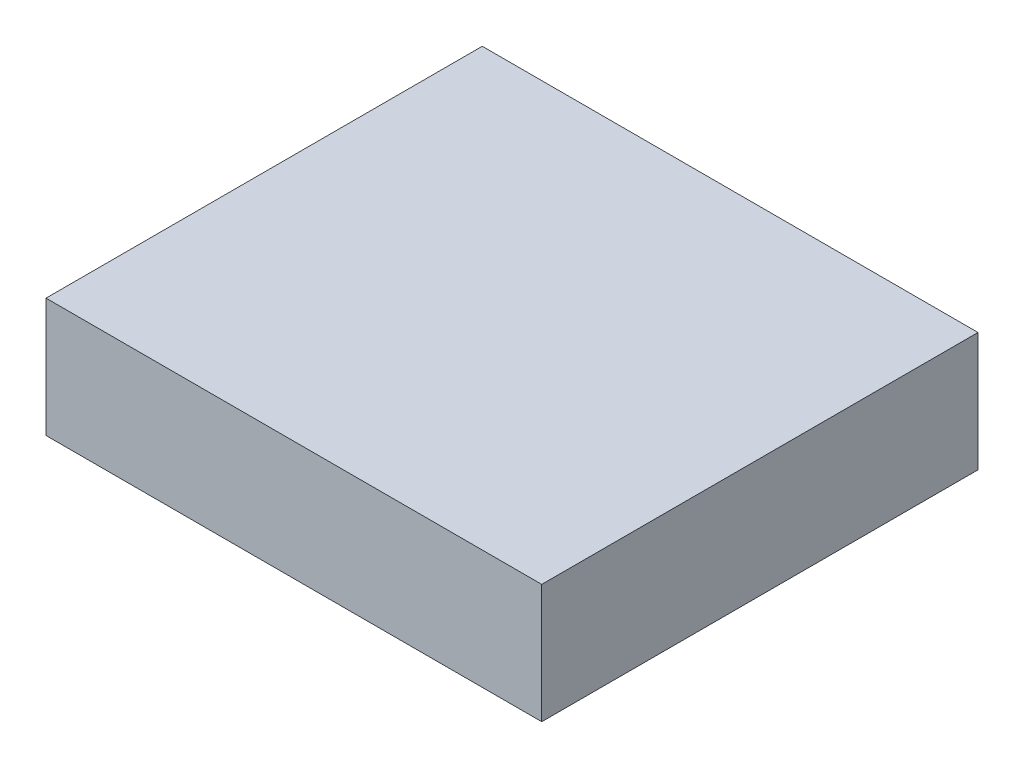
ISO-10303-21;
HEADER;
FILE_DESCRIPTION(('STEP AP214'),'2;1');
FILE_NAME('part.step','',(''),(''),'','','');
FILE_SCHEMA(('AUTOMOTIVE_DESIGN { 1 0 10303 214 1 1 1 1 }'));
ENDSEC;
DATA;
#1=APPLICATION_CONTEXT('core data for automotive mechanical design processes');
#2=APPLICATION_PROTOCOL_DEFINITION('international standard','automotive_design',2000,#1);
#3=PRODUCT_CONTEXT('',#1,'mechanical');
#4=PRODUCT('Part','Part','',(#3));
#5=PRODUCT_RELATED_PRODUCT_CATEGORY('part','',(#4));
#6=PRODUCT_DEFINITION_FORMATION('','',#4);
#7=PRODUCT_DEFINITION_CONTEXT('part definition',#1,'design');
#8=PRODUCT_DEFINITION('design','',#6,#7);
#9=PRODUCT_DEFINITION_SHAPE('','',#8);
#10=(LENGTH_UNIT() NAMED_UNIT(*) SI_UNIT(.MILLI.,.METRE.));
#11=(NAMED_UNIT(*) PLANE_ANGLE_UNIT() SI_UNIT($,.RADIAN.));
#12=(NAMED_UNIT(*) SI_UNIT($,.STERADIAN.) SOLID_ANGLE_UNIT());
#13=UNCERTAINTY_MEASURE_WITH_UNIT(LENGTH_MEASURE(1.E-05),#10,'distance_accuracy_value','');
#14=(GEOMETRIC_REPRESENTATION_CONTEXT(3) GLOBAL_UNCERTAINTY_ASSIGNED_CONTEXT((#13)) GLOBAL_UNIT_ASSIGNED_CONTEXT((#10,
#11,#12)) REPRESENTATION_CONTEXT('',''));
#15=CARTESIAN_POINT('',(0.,0.,0.));
#16=DIRECTION('',(0.,0.,1.));
#17=DIRECTION('',(1.,0.,0.));
#18=AXIS2_PLACEMENT_3D('',#15,#16,#17);
#19=CARTESIAN_POINT('',(-2.5,1.2,-2.2));
#20=DIRECTION('',(1.,0.,0.));
#21=DIRECTION('',(0.,0.,-1.));
#22=AXIS2_PLACEMENT_3D('',#19,#20,#21);
#23=PLANE('',#22);
#24=DIRECTION('',(0.,0.,1.));
#25=VECTOR('',#24,1.);
#26=CARTESIAN_POINT('',(-2.5,0.,-2.2));
#27=LINE('',#26,#25);
#28=CARTESIAN_POINT('',(-2.5,0.,-2.2));
#29=VERTEX_POINT('',#28);
#30=CARTESIAN_POINT('',(-2.5,0.,2.2));
#31=VERTEX_POINT('',#30);
#32=EDGE_CURVE('E107',#29,#31,#27,.T.);
#33=ORIENTED_EDGE('',*,*,#32,.T.);
#34=DIRECTION('',(0.,-1.,0.));
#35=VECTOR('',#34,1.);
#36=CARTESIAN_POINT('',(-2.5,1.2,2.2));
#37=LINE('',#36,#35);
#38=CARTESIAN_POINT('',(-2.5,1.2,2.2));
#39=VERTEX_POINT('',#38);
#40=EDGE_CURVE('E11',#39,#31,#37,.T.);
#41=ORIENTED_EDGE('',*,*,#40,.F.);
#42=DIRECTION('',(0.,0.,1.));
#43=VECTOR('',#42,1.);
#44=CARTESIAN_POINT('',(-2.5,1.2,-2.2));
#45=LINE('',#44,#43);
#46=CARTESIAN_POINT('',(-2.5,1.2,-2.2));
#47=VERTEX_POINT('',#46);
#48=EDGE_CURVE('E90',#47,#39,#45,.T.);
#49=ORIENTED_EDGE('',*,*,#48,.F.);
#50=DIRECTION('',(0.,-1.,0.));
#51=VECTOR('',#50,1.);
#52=CARTESIAN_POINT('',(-2.5,1.2,-2.2));
#53=LINE('',#52,#51);
#54=EDGE_CURVE('E103',#47,#29,#53,.T.);
#55=ORIENTED_EDGE('',*,*,#54,.T.);
#56=EDGE_LOOP('',(#33,#41,#49,#55));
#57=FACE_BOUND('',#56,.T.);
#58=ADVANCED_FACE('F38',(#57),#23,.F.);
#59=CARTESIAN_POINT('',(-2.5,1.2,2.2));
#60=DIRECTION('',(0.,0.,-1.));
#61=DIRECTION('',(-1.,0.,0.));
#62=AXIS2_PLACEMENT_3D('',#59,#60,#61);
#63=PLANE('',#62);
#64=DIRECTION('',(1.,0.,0.));
#65=VECTOR('',#64,1.);
#66=CARTESIAN_POINT('',(-2.5,0.,2.2));
#67=LINE('',#66,#65);
#68=CARTESIAN_POINT('',(2.5,0.,2.2));
#69=VERTEX_POINT('',#68);
#70=EDGE_CURVE('E95',#31,#69,#67,.T.);
#71=ORIENTED_EDGE('',*,*,#70,.T.);
#72=DIRECTION('',(0.,-1.,0.));
#73=VECTOR('',#72,1.);
#74=CARTESIAN_POINT('',(2.5,1.2,2.2));
#75=LINE('',#74,#73);
#76=CARTESIAN_POINT('',(2.5,1.2,2.2));
#77=VERTEX_POINT('',#76);
#78=EDGE_CURVE('E47',#77,#69,#75,.T.);
#79=ORIENTED_EDGE('',*,*,#78,.F.);
#80=DIRECTION('',(1.,0.,0.));
#81=VECTOR('',#80,1.);
#82=CARTESIAN_POINT('',(-2.5,1.2,2.2));
#83=LINE('',#82,#81);
#84=EDGE_CURVE('E85',#39,#77,#83,.T.);
#85=ORIENTED_EDGE('',*,*,#84,.F.);
#86=ORIENTED_EDGE('',*,*,#40,.T.);
#87=EDGE_LOOP('',(#71,#79,#85,#86));
#88=FACE_BOUND('',#87,.T.);
#89=ADVANCED_FACE('F94',(#88),#63,.F.);
#90=CARTESIAN_POINT('',(2.5,1.2,-2.2));
#91=DIRECTION('',(-1.,0.,0.));
#92=DIRECTION('',(0.,0.,1.));
#93=AXIS2_PLACEMENT_3D('',#90,#91,#92);
#94=PLANE('',#93);
#95=DIRECTION('',(0.,0.,-1.));
#96=VECTOR('',#95,1.);
#97=CARTESIAN_POINT('',(2.5,0.,-2.2));
#98=LINE('',#97,#96);
#99=CARTESIAN_POINT('',(2.5,0.,-2.2));
#100=VERTEX_POINT('',#99);
#101=EDGE_CURVE('E72',#69,#100,#98,.T.);
#102=ORIENTED_EDGE('',*,*,#101,.T.);
#103=DIRECTION('',(0.,-1.,0.));
#104=VECTOR('',#103,1.);
#105=CARTESIAN_POINT('',(2.5,1.2,-2.2));
#106=LINE('',#105,#104);
#107=CARTESIAN_POINT('',(2.5,1.2,-2.2));
#108=VERTEX_POINT('',#107);
#109=EDGE_CURVE('E97',#108,#100,#106,.T.);
#110=ORIENTED_EDGE('',*,*,#109,.F.);
#111=DIRECTION('',(0.,0.,-1.));
#112=VECTOR('',#111,1.);
#113=CARTESIAN_POINT('',(2.5,1.2,-2.2));
#114=LINE('',#113,#112);
#115=EDGE_CURVE('E88',#77,#108,#114,.T.);
#116=ORIENTED_EDGE('',*,*,#115,.F.);
#117=ORIENTED_EDGE('',*,*,#78,.T.);
#118=EDGE_LOOP('',(#102,#110,#116,#117));
#119=FACE_BOUND('',#118,.T.);
#120=ADVANCED_FACE('F98',(#119),#94,.F.);
#121=CARTESIAN_POINT('',(-2.5,1.2,-2.2));
#122=DIRECTION('',(0.,0.,1.));
#123=DIRECTION('',(1.,0.,0.));
#124=AXIS2_PLACEMENT_3D('',#121,#122,#123);
#125=PLANE('',#124);
#126=DIRECTION('',(-1.,0.,0.));
#127=VECTOR('',#126,1.);
#128=CARTESIAN_POINT('',(-2.5,0.,-2.2));
#129=LINE('',#128,#127);
#130=EDGE_CURVE('E78',#100,#29,#129,.T.);
#131=ORIENTED_EDGE('',*,*,#130,.T.);
#132=ORIENTED_EDGE('',*,*,#54,.F.);
#133=DIRECTION('',(-1.,0.,0.));
#134=VECTOR('',#133,1.);
#135=CARTESIAN_POINT('',(-2.5,1.2,-2.2));
#136=LINE('',#135,#134);
#137=EDGE_CURVE('E55',#108,#47,#136,.T.);
#138=ORIENTED_EDGE('',*,*,#137,.F.);
#139=ORIENTED_EDGE('',*,*,#109,.T.);
#140=EDGE_LOOP('',(#131,#132,#138,#139));
#141=FACE_BOUND('',#140,.T.);
#142=ADVANCED_FACE('F119',(#141),#125,.F.);
#143=CARTESIAN_POINT('',(0.,1.2,0.));
#144=DIRECTION('',(0.,1.,0.));
#145=DIRECTION('',(0.,0.,1.));
#146=AXIS2_PLACEMENT_3D('',#143,#144,#145);
#147=PLANE('',#146);
#148=ORIENTED_EDGE('',*,*,#48,.T.);
#149=ORIENTED_EDGE('',*,*,#84,.T.);
#150=ORIENTED_EDGE('',*,*,#115,.T.);
#151=ORIENTED_EDGE('',*,*,#137,.T.);
#152=EDGE_LOOP('',(#148,#149,#150,#151));
#153=FACE_BOUND('',#152,.T.);
#154=ADVANCED_FACE('F86',(#153),#147,.T.);
#155=CARTESIAN_POINT('',(0.,0.,0.));
#156=DIRECTION('',(0.,1.,0.));
#157=DIRECTION('',(0.,0.,1.));
#158=AXIS2_PLACEMENT_3D('',#155,#156,#157);
#159=PLANE('',#158);
#160=ORIENTED_EDGE('',*,*,#32,.F.);
#161=ORIENTED_EDGE('',*,*,#130,.F.);
#162=ORIENTED_EDGE('',*,*,#101,.F.);
#163=ORIENTED_EDGE('',*,*,#70,.F.);
#164=EDGE_LOOP('',(#160,#161,#162,#163));
#165=FACE_BOUND('',#164,.T.);
#166=ADVANCED_FACE('F122',(#165),#159,.F.);
#167=CLOSED_SHELL('',(#58,#89,#120,#142,#154,#166));
#168=MANIFOLD_SOLID_BREP('B2',#167);
#169=ADVANCED_BREP_SHAPE_REPRESENTATION('',(#18,#168),#14);
#170=SHAPE_DEFINITION_REPRESENTATION(#9,#169);
ENDSEC;
END-ISO-10303-21;
